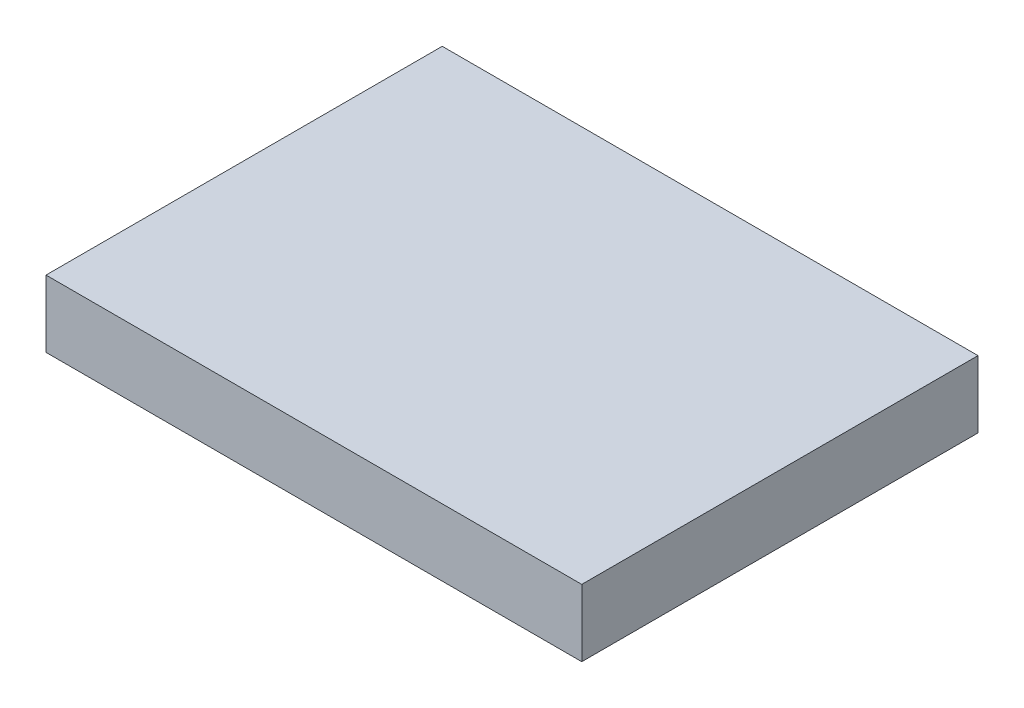
ISO-10303-21;
HEADER;
FILE_DESCRIPTION(('STEP AP214'),'2;1');
FILE_NAME('part.step','',(''),(''),'','','');
FILE_SCHEMA(('AUTOMOTIVE_DESIGN { 1 0 10303 214 1 1 1 1 }'));
ENDSEC;
DATA;
#1=APPLICATION_CONTEXT('core data for automotive mechanical design processes');
#2=APPLICATION_PROTOCOL_DEFINITION('international standard','automotive_design',2000,#1);
#3=PRODUCT_CONTEXT('',#1,'mechanical');
#4=PRODUCT('Part','Part','',(#3));
#5=PRODUCT_RELATED_PRODUCT_CATEGORY('part','',(#4));
#6=PRODUCT_DEFINITION_FORMATION('','',#4);
#7=PRODUCT_DEFINITION_CONTEXT('part definition',#1,'design');
#8=PRODUCT_DEFINITION('design','',#6,#7);
#9=PRODUCT_DEFINITION_SHAPE('','',#8);
#10=(LENGTH_UNIT() NAMED_UNIT(*) SI_UNIT(.MILLI.,.METRE.));
#11=(NAMED_UNIT(*) PLANE_ANGLE_UNIT() SI_UNIT($,.RADIAN.));
#12=(NAMED_UNIT(*) SI_UNIT($,.STERADIAN.) SOLID_ANGLE_UNIT());
#13=UNCERTAINTY_MEASURE_WITH_UNIT(LENGTH_MEASURE(1.E-05),#10,'distance_accuracy_value','');
#14=(GEOMETRIC_REPRESENTATION_CONTEXT(3) GLOBAL_UNCERTAINTY_ASSIGNED_CONTEXT((#13)) GLOBAL_UNIT_ASSIGNED_CONTEXT((#10,
#11,#12)) REPRESENTATION_CONTEXT('',''));
#15=CARTESIAN_POINT('',(0.,0.,0.));
#16=DIRECTION('',(0.,0.,1.));
#17=DIRECTION('',(1.,0.,0.));
#18=AXIS2_PLACEMENT_3D('',#15,#16,#17);
#19=CARTESIAN_POINT('',(0.,3.,0.));
#20=DIRECTION('',(-1.,0.,0.));
#21=DIRECTION('',(0.,0.,1.));
#22=AXIS2_PLACEMENT_3D('',#19,#20,#21);
#23=PLANE('',#22);
#24=DIRECTION('',(0.,0.,-1.));
#25=VECTOR('',#24,1.);
#26=CARTESIAN_POINT('',(0.,0.,0.));
#27=LINE('',#26,#25);
#28=CARTESIAN_POINT('',(0.,0.,0.));
#29=VERTEX_POINT('',#28);
#30=CARTESIAN_POINT('',(0.,0.,-17.75));
#31=VERTEX_POINT('',#30);
#32=EDGE_CURVE('E96',#29,#31,#27,.T.);
#33=ORIENTED_EDGE('',*,*,#32,.T.);
#34=DIRECTION('',(0.,-1.,0.));
#35=VECTOR('',#34,1.);
#36=CARTESIAN_POINT('',(0.,3.,-17.75));
#37=LINE('',#36,#35);
#38=CARTESIAN_POINT('',(0.,3.,-17.75));
#39=VERTEX_POINT('',#38);
#40=EDGE_CURVE('E11',#39,#31,#37,.T.);
#41=ORIENTED_EDGE('',*,*,#40,.F.);
#42=DIRECTION('',(0.,0.,-1.));
#43=VECTOR('',#42,1.);
#44=CARTESIAN_POINT('',(0.,3.,0.));
#45=LINE('',#44,#43);
#46=CARTESIAN_POINT('',(0.,3.,0.));
#47=VERTEX_POINT('',#46);
#48=EDGE_CURVE('E84',#47,#39,#45,.T.);
#49=ORIENTED_EDGE('',*,*,#48,.F.);
#50=DIRECTION('',(0.,-1.,0.));
#51=VECTOR('',#50,1.);
#52=CARTESIAN_POINT('',(0.,3.,0.));
#53=LINE('',#52,#51);
#54=EDGE_CURVE('E92',#47,#29,#53,.T.);
#55=ORIENTED_EDGE('',*,*,#54,.T.);
#56=EDGE_LOOP('',(#33,#41,#49,#55));
#57=FACE_BOUND('',#56,.T.);
#58=ADVANCED_FACE('F33',(#57),#23,.F.);
#59=CARTESIAN_POINT('',(0.,3.,-17.75));
#60=DIRECTION('',(0.,0.,1.));
#61=DIRECTION('',(1.,0.,0.));
#62=AXIS2_PLACEMENT_3D('',#59,#60,#61);
#63=PLANE('',#62);
#64=DIRECTION('',(-1.,0.,0.));
#65=VECTOR('',#64,1.);
#66=CARTESIAN_POINT('',(0.,0.,-17.75));
#67=LINE('',#66,#65);
#68=CARTESIAN_POINT('',(-24.,0.,-17.75));
#69=VERTEX_POINT('',#68);
#70=EDGE_CURVE('E88',#31,#69,#67,.T.);
#71=ORIENTED_EDGE('',*,*,#70,.T.);
#72=DIRECTION('',(0.,-1.,0.));
#73=VECTOR('',#72,1.);
#74=CARTESIAN_POINT('',(-24.,3.,-17.75));
#75=LINE('',#74,#73);
#76=CARTESIAN_POINT('',(-24.,3.,-17.75));
#77=VERTEX_POINT('',#76);
#78=EDGE_CURVE('E41',#77,#69,#75,.T.);
#79=ORIENTED_EDGE('',*,*,#78,.F.);
#80=DIRECTION('',(-1.,0.,0.));
#81=VECTOR('',#80,1.);
#82=CARTESIAN_POINT('',(0.,3.,-17.75));
#83=LINE('',#82,#81);
#84=EDGE_CURVE('E79',#39,#77,#83,.T.);
#85=ORIENTED_EDGE('',*,*,#84,.F.);
#86=ORIENTED_EDGE('',*,*,#40,.T.);
#87=EDGE_LOOP('',(#71,#79,#85,#86));
#88=FACE_BOUND('',#87,.T.);
#89=ADVANCED_FACE('F87',(#88),#63,.F.);
#90=CARTESIAN_POINT('',(-24.,3.,0.));
#91=DIRECTION('',(1.,0.,0.));
#92=DIRECTION('',(0.,0.,-1.));
#93=AXIS2_PLACEMENT_3D('',#90,#91,#92);
#94=PLANE('',#93);
#95=DIRECTION('',(0.,0.,1.));
#96=VECTOR('',#95,1.);
#97=CARTESIAN_POINT('',(-24.,0.,0.));
#98=LINE('',#97,#96);
#99=CARTESIAN_POINT('',(-24.,0.,0.));
#100=VERTEX_POINT('',#99);
#101=EDGE_CURVE('E66',#69,#100,#98,.T.);
#102=ORIENTED_EDGE('',*,*,#101,.T.);
#103=DIRECTION('',(0.,-1.,0.));
#104=VECTOR('',#103,1.);
#105=CARTESIAN_POINT('',(-24.,3.,0.));
#106=LINE('',#105,#104);
#107=CARTESIAN_POINT('',(-24.,3.,0.));
#108=VERTEX_POINT('',#107);
#109=EDGE_CURVE('E89',#108,#100,#106,.T.);
#110=ORIENTED_EDGE('',*,*,#109,.F.);
#111=DIRECTION('',(0.,0.,1.));
#112=VECTOR('',#111,1.);
#113=CARTESIAN_POINT('',(-24.,3.,0.));
#114=LINE('',#113,#112);
#115=EDGE_CURVE('E82',#77,#108,#114,.T.);
#116=ORIENTED_EDGE('',*,*,#115,.F.);
#117=ORIENTED_EDGE('',*,*,#78,.T.);
#118=EDGE_LOOP('',(#102,#110,#116,#117));
#119=FACE_BOUND('',#118,.T.);
#120=ADVANCED_FACE('F90',(#119),#94,.F.);
#121=CARTESIAN_POINT('',(0.,3.,0.));
#122=DIRECTION('',(0.,0.,-1.));
#123=DIRECTION('',(-1.,0.,0.));
#124=AXIS2_PLACEMENT_3D('',#121,#122,#123);
#125=PLANE('',#124);
#126=DIRECTION('',(1.,0.,0.));
#127=VECTOR('',#126,1.);
#128=CARTESIAN_POINT('',(0.,0.,0.));
#129=LINE('',#128,#127);
#130=EDGE_CURVE('E72',#100,#29,#129,.T.);
#131=ORIENTED_EDGE('',*,*,#130,.T.);
#132=ORIENTED_EDGE('',*,*,#54,.F.);
#133=DIRECTION('',(1.,0.,0.));
#134=VECTOR('',#133,1.);
#135=CARTESIAN_POINT('',(0.,3.,0.));
#136=LINE('',#135,#134);
#137=EDGE_CURVE('E49',#108,#47,#136,.T.);
#138=ORIENTED_EDGE('',*,*,#137,.F.);
#139=ORIENTED_EDGE('',*,*,#109,.T.);
#140=EDGE_LOOP('',(#131,#132,#138,#139));
#141=FACE_BOUND('',#140,.T.);
#142=ADVANCED_FACE('F103',(#141),#125,.F.);
#143=CARTESIAN_POINT('',(0.,3.,0.));
#144=DIRECTION('',(0.,1.,0.));
#145=DIRECTION('',(0.,0.,1.));
#146=AXIS2_PLACEMENT_3D('',#143,#144,#145);
#147=PLANE('',#146);
#148=ORIENTED_EDGE('',*,*,#48,.T.);
#149=ORIENTED_EDGE('',*,*,#84,.T.);
#150=ORIENTED_EDGE('',*,*,#115,.T.);
#151=ORIENTED_EDGE('',*,*,#137,.T.);
#152=EDGE_LOOP('',(#148,#149,#150,#151));
#153=FACE_BOUND('',#152,.T.);
#154=ADVANCED_FACE('F80',(#153),#147,.T.);
#155=CARTESIAN_POINT('',(0.,0.,0.));
#156=DIRECTION('',(0.,1.,0.));
#157=DIRECTION('',(0.,0.,1.));
#158=AXIS2_PLACEMENT_3D('',#155,#156,#157);
#159=PLANE('',#158);
#160=ORIENTED_EDGE('',*,*,#32,.F.);
#161=ORIENTED_EDGE('',*,*,#130,.F.);
#162=ORIENTED_EDGE('',*,*,#101,.F.);
#163=ORIENTED_EDGE('',*,*,#70,.F.);
#164=EDGE_LOOP('',(#160,#161,#162,#163));
#165=FACE_BOUND('',#164,.T.);
#166=ADVANCED_FACE('F106',(#165),#159,.F.);
#167=CLOSED_SHELL('',(#58,#89,#120,#142,#154,#166));
#168=MANIFOLD_SOLID_BREP('B2',#167);
#169=ADVANCED_BREP_SHAPE_REPRESENTATION('',(#18,#168),#14);
#170=SHAPE_DEFINITION_REPRESENTATION(#9,#169);
ENDSEC;
END-ISO-10303-21;
